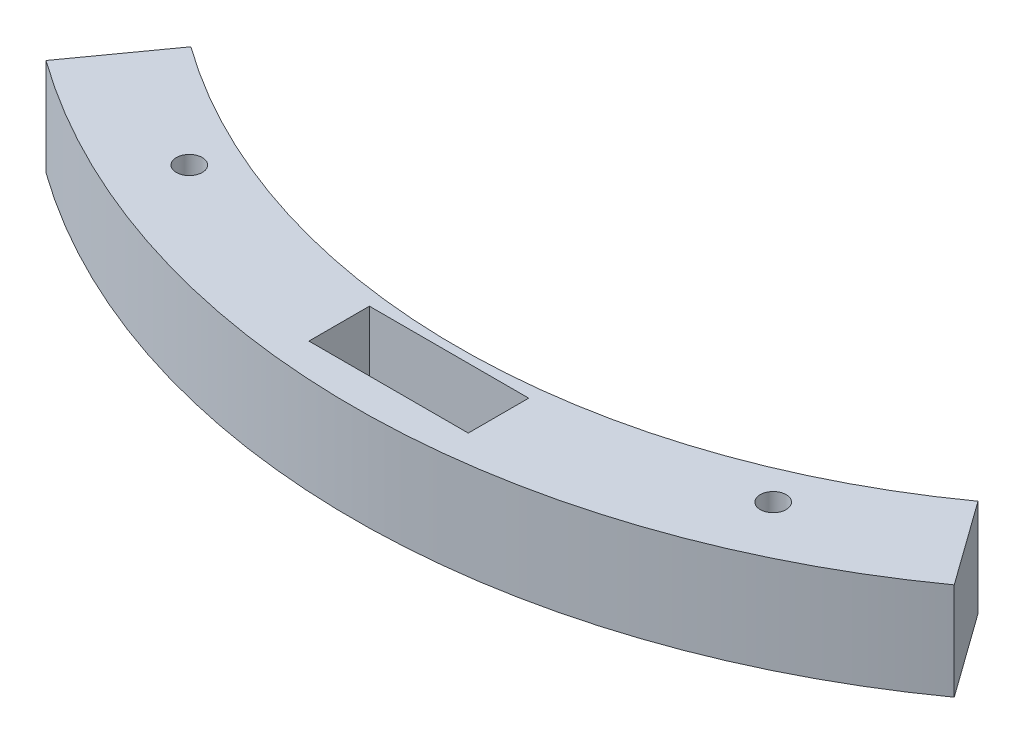
ISO-10303-21;
HEADER;
FILE_DESCRIPTION(('STEP AP214'),'2;1');
FILE_NAME('part.step','',(''),(''),'','','');
FILE_SCHEMA(('AUTOMOTIVE_DESIGN { 1 0 10303 214 1 1 1 1 }'));
ENDSEC;
DATA;
#1=APPLICATION_CONTEXT('core data for automotive mechanical design processes');
#2=APPLICATION_PROTOCOL_DEFINITION('international standard','automotive_design',2000,#1);
#3=PRODUCT_CONTEXT('',#1,'mechanical');
#4=PRODUCT('Part','Part','',(#3));
#5=PRODUCT_RELATED_PRODUCT_CATEGORY('part','',(#4));
#6=PRODUCT_DEFINITION_FORMATION('','',#4);
#7=PRODUCT_DEFINITION_CONTEXT('part definition',#1,'design');
#8=PRODUCT_DEFINITION('design','',#6,#7);
#9=PRODUCT_DEFINITION_SHAPE('','',#8);
#10=(LENGTH_UNIT() NAMED_UNIT(*) SI_UNIT(.MILLI.,.METRE.));
#11=(NAMED_UNIT(*) PLANE_ANGLE_UNIT() SI_UNIT($,.RADIAN.));
#12=(NAMED_UNIT(*) SI_UNIT($,.STERADIAN.) SOLID_ANGLE_UNIT());
#13=UNCERTAINTY_MEASURE_WITH_UNIT(LENGTH_MEASURE(1.E-05),#10,'distance_accuracy_value','');
#14=(GEOMETRIC_REPRESENTATION_CONTEXT(3) GLOBAL_UNCERTAINTY_ASSIGNED_CONTEXT((#13)) GLOBAL_UNIT_ASSIGNED_CONTEXT((#10,
#11,#12)) REPRESENTATION_CONTEXT('',''));
#15=CARTESIAN_POINT('',(0.,0.,0.));
#16=DIRECTION('',(0.,0.,1.));
#17=DIRECTION('',(1.,0.,0.));
#18=AXIS2_PLACEMENT_3D('',#15,#16,#17);
#19=CARTESIAN_POINT('',(-5.14,7.5,56.33));
#20=DIRECTION('',(0.,0.,-1.));
#21=DIRECTION('',(-1.,0.,0.));
#22=AXIS2_PLACEMENT_3D('',#19,#20,#21);
#23=PLANE('',#22);
#24=DIRECTION('',(0.,-1.,0.));
#25=VECTOR('',#24,1.);
#26=CARTESIAN_POINT('',(-5.14,7.5,56.33));
#27=LINE('',#26,#25);
#28=CARTESIAN_POINT('',(-5.14,2.,56.33));
#29=VERTEX_POINT('',#28);
#30=CARTESIAN_POINT('',(-5.14,0.,56.33));
#31=VERTEX_POINT('',#30);
#32=EDGE_CURVE('E189',#29,#31,#27,.T.);
#33=ORIENTED_EDGE('',*,*,#32,.F.);
#34=DIRECTION('',(1.,0.,0.));
#35=VECTOR('',#34,1.);
#36=CARTESIAN_POINT('',(-5.14,2.,56.33));
#37=LINE('',#36,#35);
#38=CARTESIAN_POINT('',(5.14000000000001,2.,56.33));
#39=VERTEX_POINT('',#38);
#40=EDGE_CURVE('E58',#29,#39,#37,.T.);
#41=ORIENTED_EDGE('',*,*,#40,.T.);
#42=DIRECTION('',(0.,-1.,0.));
#43=VECTOR('',#42,1.);
#44=CARTESIAN_POINT('',(5.14000000000001,7.5,56.33));
#45=LINE('',#44,#43);
#46=CARTESIAN_POINT('',(5.14000000000001,0.,56.33));
#47=VERTEX_POINT('',#46);
#48=EDGE_CURVE('E195',#39,#47,#45,.T.);
#49=ORIENTED_EDGE('',*,*,#48,.T.);
#50=DIRECTION('',(1.,0.,0.));
#51=VECTOR('',#50,1.);
#52=CARTESIAN_POINT('',(-5.14,0.,56.33));
#53=LINE('',#52,#51);
#54=EDGE_CURVE('E175',#31,#47,#53,.T.);
#55=ORIENTED_EDGE('',*,*,#54,.F.);
#56=EDGE_LOOP('',(#33,#41,#49,#55));
#57=FACE_BOUND('',#56,.T.);
#58=ADVANCED_FACE('F35',(#57),#23,.T.);
#59=CARTESIAN_POINT('',(5.14000000000001,7.5,56.33));
#60=DIRECTION('',(-1.,0.,0.));
#61=DIRECTION('',(0.,0.,1.));
#62=AXIS2_PLACEMENT_3D('',#59,#60,#61);
#63=PLANE('',#62);
#64=ORIENTED_EDGE('',*,*,#48,.F.);
#65=DIRECTION('',(0.,0.,-1.));
#66=VECTOR('',#65,1.);
#67=CARTESIAN_POINT('',(5.14000000000001,2.,56.33));
#68=LINE('',#67,#66);
#69=CARTESIAN_POINT('',(5.14000000000001,2.,53.67));
#70=VERTEX_POINT('',#69);
#71=EDGE_CURVE('E161',#39,#70,#68,.T.);
#72=ORIENTED_EDGE('',*,*,#71,.T.);
#73=DIRECTION('',(0.,-1.,0.));
#74=VECTOR('',#73,1.);
#75=CARTESIAN_POINT('',(5.14000000000001,7.5,53.67));
#76=LINE('',#75,#74);
#77=CARTESIAN_POINT('',(5.14000000000001,0.,53.67));
#78=VERTEX_POINT('',#77);
#79=EDGE_CURVE('E193',#70,#78,#76,.T.);
#80=ORIENTED_EDGE('',*,*,#79,.T.);
#81=DIRECTION('',(0.,0.,-1.));
#82=VECTOR('',#81,1.);
#83=CARTESIAN_POINT('',(5.14000000000001,0.,56.33));
#84=LINE('',#83,#82);
#85=EDGE_CURVE('E180',#47,#78,#84,.T.);
#86=ORIENTED_EDGE('',*,*,#85,.F.);
#87=EDGE_LOOP('',(#64,#72,#80,#86));
#88=FACE_BOUND('',#87,.T.);
#89=ADVANCED_FACE('F266',(#88),#63,.T.);
#90=CARTESIAN_POINT('',(-5.14,7.5,53.67));
#91=DIRECTION('',(0.,0.,1.));
#92=DIRECTION('',(1.,0.,0.));
#93=AXIS2_PLACEMENT_3D('',#90,#91,#92);
#94=PLANE('',#93);
#95=ORIENTED_EDGE('',*,*,#79,.F.);
#96=DIRECTION('',(-1.,0.,0.));
#97=VECTOR('',#96,1.);
#98=CARTESIAN_POINT('',(-5.14,2.,53.67));
#99=LINE('',#98,#97);
#100=CARTESIAN_POINT('',(-5.14,2.,53.67));
#101=VERTEX_POINT('',#100);
#102=EDGE_CURVE('E157',#70,#101,#99,.T.);
#103=ORIENTED_EDGE('',*,*,#102,.T.);
#104=DIRECTION('',(0.,-1.,0.));
#105=VECTOR('',#104,1.);
#106=CARTESIAN_POINT('',(-5.14,7.5,53.67));
#107=LINE('',#106,#105);
#108=CARTESIAN_POINT('',(-5.14,0.,53.67));
#109=VERTEX_POINT('',#108);
#110=EDGE_CURVE('E191',#101,#109,#107,.T.);
#111=ORIENTED_EDGE('',*,*,#110,.T.);
#112=DIRECTION('',(-1.,0.,0.));
#113=VECTOR('',#112,1.);
#114=CARTESIAN_POINT('',(-5.14,0.,53.67));
#115=LINE('',#114,#113);
#116=EDGE_CURVE('E183',#78,#109,#115,.T.);
#117=ORIENTED_EDGE('',*,*,#116,.F.);
#118=EDGE_LOOP('',(#95,#103,#111,#117));
#119=FACE_BOUND('',#118,.T.);
#120=ADVANCED_FACE('F272',(#119),#94,.T.);
#121=CARTESIAN_POINT('',(-5.14,7.5,56.33));
#122=DIRECTION('',(1.,0.,0.));
#123=DIRECTION('',(0.,0.,-1.));
#124=AXIS2_PLACEMENT_3D('',#121,#122,#123);
#125=PLANE('',#124);
#126=ORIENTED_EDGE('',*,*,#110,.F.);
#127=DIRECTION('',(0.,0.,1.));
#128=VECTOR('',#127,1.);
#129=CARTESIAN_POINT('',(-5.14,2.,56.33));
#130=LINE('',#129,#128);
#131=EDGE_CURVE('E12',#101,#29,#130,.T.);
#132=ORIENTED_EDGE('',*,*,#131,.T.);
#133=ORIENTED_EDGE('',*,*,#32,.T.);
#134=DIRECTION('',(0.,0.,1.));
#135=VECTOR('',#134,1.);
#136=CARTESIAN_POINT('',(-5.14,0.,56.33));
#137=LINE('',#136,#135);
#138=EDGE_CURVE('E186',#109,#31,#137,.T.);
#139=ORIENTED_EDGE('',*,*,#138,.F.);
#140=EDGE_LOOP('',(#126,#132,#133,#139));
#141=FACE_BOUND('',#140,.T.);
#142=ADVANCED_FACE('F247',(#141),#125,.T.);
#143=CARTESIAN_POINT('',(0.,7.5,0.));
#144=DIRECTION('',(0.,1.,0.));
#145=DIRECTION('',(0.,0.,1.));
#146=AXIS2_PLACEMENT_3D('',#143,#144,#145);
#147=PLANE('',#146);
#148=DIRECTION('',(0.,0.,-1.));
#149=VECTOR('',#148,1.);
#150=CARTESIAN_POINT('',(6.14000000000001,7.5,57.33));
#151=LINE('',#150,#149);
#152=CARTESIAN_POINT('',(6.14000000000001,7.5,57.33));
#153=VERTEX_POINT('',#152);
#154=CARTESIAN_POINT('',(6.14000000000001,7.5,52.67));
#155=VERTEX_POINT('',#154);
#156=EDGE_CURVE('E50',#153,#155,#151,.T.);
#157=ORIENTED_EDGE('',*,*,#156,.F.);
#158=DIRECTION('',(1.,0.,0.));
#159=VECTOR('',#158,1.);
#160=CARTESIAN_POINT('',(-6.14,7.5,57.33));
#161=LINE('',#160,#159);
#162=CARTESIAN_POINT('',(-6.14,7.5,57.33));
#163=VERTEX_POINT('',#162);
#164=EDGE_CURVE('E146',#163,#153,#161,.T.);
#165=ORIENTED_EDGE('',*,*,#164,.F.);
#166=DIRECTION('',(0.,0.,1.));
#167=VECTOR('',#166,1.);
#168=CARTESIAN_POINT('',(-6.14,7.5,52.67));
#169=LINE('',#168,#167);
#170=CARTESIAN_POINT('',(-6.14,7.5,52.67));
#171=VERTEX_POINT('',#170);
#172=EDGE_CURVE('E129',#171,#163,#169,.T.);
#173=ORIENTED_EDGE('',*,*,#172,.F.);
#174=DIRECTION('',(-1.,0.,0.));
#175=VECTOR('',#174,1.);
#176=CARTESIAN_POINT('',(6.14000000000001,7.5,52.67));
#177=LINE('',#176,#175);
#178=EDGE_CURVE('E139',#155,#171,#177,.T.);
#179=ORIENTED_EDGE('',*,*,#178,.F.);
#180=EDGE_LOOP('',(#157,#165,#173,#179));
#181=FACE_BOUND('',#180,.T.);
#182=CARTESIAN_POINT('',(-22.5,7.5,50.1871497497118));
#183=DIRECTION('',(0.,1.,0.));
#184=DIRECTION('',(0.,0.,1.));
#185=AXIS2_PLACEMENT_3D('',#182,#183,#184);
#186=CIRCLE('',#185,1.);
#187=CARTESIAN_POINT('',(-22.5,7.5,51.1871497497118));
#188=VERTEX_POINT('',#187);
#189=EDGE_CURVE('E172',#188,#188,#186,.T.);
#190=ORIENTED_EDGE('',*,*,#189,.F.);
#191=EDGE_LOOP('',(#190));
#192=FACE_BOUND('',#191,.T.);
#193=CARTESIAN_POINT('',(0.,7.5,0.));
#194=DIRECTION('',(0.,-1.,0.));
#195=DIRECTION('',(0.,0.,1.));
#196=AXIS2_PLACEMENT_3D('',#193,#194,#195);
#197=CIRCLE('',#196,52.);
#198=CARTESIAN_POINT('',(30.3333333333333,7.5,42.2361088275055));
#199=VERTEX_POINT('',#198);
#200=CARTESIAN_POINT('',(-30.3333333333333,7.5,42.2361088275055));
#201=VERTEX_POINT('',#200);
#202=EDGE_CURVE('E198',#199,#201,#197,.T.);
#203=ORIENTED_EDGE('',*,*,#202,.T.);
#204=DIRECTION('',(-0.583333333333332,0.,0.812232862067415));
#205=VECTOR('',#204,1.);
#206=CARTESIAN_POINT('',(-35.,7.5,48.7339717240448));
#207=LINE('',#206,#205);
#208=CARTESIAN_POINT('',(-35.,7.5,48.7339717240448));
#209=VERTEX_POINT('',#208);
#210=EDGE_CURVE('E201',#201,#209,#207,.T.);
#211=ORIENTED_EDGE('',*,*,#210,.T.);
#212=CARTESIAN_POINT('',(0.,7.5,0.));
#213=DIRECTION('',(0.,1.,0.));
#214=DIRECTION('',(0.,0.,1.));
#215=AXIS2_PLACEMENT_3D('',#212,#213,#214);
#216=CIRCLE('',#215,60.);
#217=CARTESIAN_POINT('',(35.,7.5,48.7339717240448));
#218=VERTEX_POINT('',#217);
#219=EDGE_CURVE('E204',#209,#218,#216,.T.);
#220=ORIENTED_EDGE('',*,*,#219,.T.);
#221=DIRECTION('',(-0.583333333333334,0.,-0.812232862067413));
#222=VECTOR('',#221,1.);
#223=CARTESIAN_POINT('',(35.,7.5,48.7339717240448));
#224=LINE('',#223,#222);
#225=EDGE_CURVE('E206',#218,#199,#224,.T.);
#226=ORIENTED_EDGE('',*,*,#225,.T.);
#227=EDGE_LOOP('',(#203,#211,#220,#226));
#228=FACE_BOUND('',#227,.T.);
#229=CARTESIAN_POINT('',(22.5,7.5,50.1871497497118));
#230=DIRECTION('',(0.,1.,0.));
#231=DIRECTION('',(0.,0.,1.));
#232=AXIS2_PLACEMENT_3D('',#229,#230,#231);
#233=CIRCLE('',#232,1.);
#234=CARTESIAN_POINT('',(22.5,7.5,51.1871497497118));
#235=VERTEX_POINT('',#234);
#236=EDGE_CURVE('E166',#235,#235,#233,.T.);
#237=ORIENTED_EDGE('',*,*,#236,.F.);
#238=EDGE_LOOP('',(#237));
#239=FACE_BOUND('',#238,.T.);
#240=ADVANCED_FACE('F143',(#181,#192,#228,#239),#147,.T.);
#241=CARTESIAN_POINT('',(0.,0.,0.));
#242=DIRECTION('',(0.,1.,0.));
#243=DIRECTION('',(0.,0.,1.));
#244=AXIS2_PLACEMENT_3D('',#241,#242,#243);
#245=PLANE('',#244);
#246=CARTESIAN_POINT('',(0.,0.,0.));
#247=DIRECTION('',(0.,-1.,0.));
#248=DIRECTION('',(0.,0.,1.));
#249=AXIS2_PLACEMENT_3D('',#246,#247,#248);
#250=CIRCLE('',#249,52.);
#251=CARTESIAN_POINT('',(30.3333333333333,0.,42.2361088275055));
#252=VERTEX_POINT('',#251);
#253=CARTESIAN_POINT('',(-30.3333333333333,0.,42.2361088275055));
#254=VERTEX_POINT('',#253);
#255=EDGE_CURVE('E197',#252,#254,#250,.T.);
#256=ORIENTED_EDGE('',*,*,#255,.F.);
#257=DIRECTION('',(-0.583333333333334,0.,-0.812232862067413));
#258=VECTOR('',#257,1.);
#259=CARTESIAN_POINT('',(35.,0.,48.7339717240448));
#260=LINE('',#259,#258);
#261=CARTESIAN_POINT('',(35.,0.,48.7339717240448));
#262=VERTEX_POINT('',#261);
#263=EDGE_CURVE('E202',#262,#252,#260,.T.);
#264=ORIENTED_EDGE('',*,*,#263,.F.);
#265=CARTESIAN_POINT('',(0.,0.,0.));
#266=DIRECTION('',(0.,1.,0.));
#267=DIRECTION('',(0.,0.,1.));
#268=AXIS2_PLACEMENT_3D('',#265,#266,#267);
#269=CIRCLE('',#268,60.);
#270=CARTESIAN_POINT('',(-35.,0.,48.7339717240448));
#271=VERTEX_POINT('',#270);
#272=EDGE_CURVE('E213',#271,#262,#269,.T.);
#273=ORIENTED_EDGE('',*,*,#272,.F.);
#274=DIRECTION('',(-0.583333333333332,0.,0.812232862067415));
#275=VECTOR('',#274,1.);
#276=CARTESIAN_POINT('',(-35.,0.,48.7339717240448));
#277=LINE('',#276,#275);
#278=EDGE_CURVE('E211',#254,#271,#277,.T.);
#279=ORIENTED_EDGE('',*,*,#278,.F.);
#280=EDGE_LOOP('',(#256,#264,#273,#279));
#281=FACE_BOUND('',#280,.T.);
#282=ORIENTED_EDGE('',*,*,#54,.T.);
#283=ORIENTED_EDGE('',*,*,#85,.T.);
#284=ORIENTED_EDGE('',*,*,#116,.T.);
#285=ORIENTED_EDGE('',*,*,#138,.T.);
#286=EDGE_LOOP('',(#282,#283,#284,#285));
#287=FACE_BOUND('',#286,.T.);
#288=CARTESIAN_POINT('',(-22.5,0.,50.1871497497118));
#289=DIRECTION('',(0.,1.,0.));
#290=DIRECTION('',(0.,0.,1.));
#291=AXIS2_PLACEMENT_3D('',#288,#289,#290);
#292=CIRCLE('',#291,1.);
#293=CARTESIAN_POINT('',(-22.5,0.,51.1871497497118));
#294=VERTEX_POINT('',#293);
#295=EDGE_CURVE('E169',#294,#294,#292,.T.);
#296=ORIENTED_EDGE('',*,*,#295,.T.);
#297=EDGE_LOOP('',(#296));
#298=FACE_BOUND('',#297,.T.);
#299=CARTESIAN_POINT('',(22.5,0.,50.1871497497118));
#300=DIRECTION('',(0.,1.,0.));
#301=DIRECTION('',(0.,0.,1.));
#302=AXIS2_PLACEMENT_3D('',#299,#300,#301);
#303=CIRCLE('',#302,1.);
#304=CARTESIAN_POINT('',(22.5,0.,51.1871497497118));
#305=VERTEX_POINT('',#304);
#306=EDGE_CURVE('E165',#305,#305,#303,.T.);
#307=ORIENTED_EDGE('',*,*,#306,.T.);
#308=EDGE_LOOP('',(#307));
#309=FACE_BOUND('',#308,.T.);
#310=ADVANCED_FACE('F234',(#281,#287,#298,#309),#245,.F.);
#311=CARTESIAN_POINT('',(0.,7.5,0.));
#312=DIRECTION('',(0.,-1.,0.));
#313=DIRECTION('',(0.,0.,-1.));
#314=AXIS2_PLACEMENT_3D('',#311,#312,#313);
#315=CYLINDRICAL_SURFACE('',#314,52.);
#316=ORIENTED_EDGE('',*,*,#255,.T.);
#317=DIRECTION('',(0.,-1.,0.));
#318=VECTOR('',#317,1.);
#319=CARTESIAN_POINT('',(-30.3333333333333,7.5,42.2361088275055));
#320=LINE('',#319,#318);
#321=EDGE_CURVE('E43',#201,#254,#320,.T.);
#322=ORIENTED_EDGE('',*,*,#321,.F.);
#323=ORIENTED_EDGE('',*,*,#202,.F.);
#324=DIRECTION('',(0.,-1.,0.));
#325=VECTOR('',#324,1.);
#326=CARTESIAN_POINT('',(30.3333333333333,7.5,42.2361088275055));
#327=LINE('',#326,#325);
#328=EDGE_CURVE('E208',#199,#252,#327,.T.);
#329=ORIENTED_EDGE('',*,*,#328,.T.);
#330=EDGE_LOOP('',(#316,#322,#323,#329));
#331=FACE_BOUND('',#330,.T.);
#332=ADVANCED_FACE('F37',(#331),#315,.F.);
#333=CARTESIAN_POINT('',(-35.,7.5,48.7339717240448));
#334=DIRECTION('',(0.812232862067415,0.,0.583333333333332));
#335=DIRECTION('',(0.583333333333332,0.,-0.812232862067415));
#336=AXIS2_PLACEMENT_3D('',#333,#334,#335);
#337=PLANE('',#336);
#338=ORIENTED_EDGE('',*,*,#278,.T.);
#339=DIRECTION('',(0.,-1.,0.));
#340=VECTOR('',#339,1.);
#341=CARTESIAN_POINT('',(-35.,7.5,48.7339717240448));
#342=LINE('',#341,#340);
#343=EDGE_CURVE('E221',#209,#271,#342,.T.);
#344=ORIENTED_EDGE('',*,*,#343,.F.);
#345=ORIENTED_EDGE('',*,*,#210,.F.);
#346=ORIENTED_EDGE('',*,*,#321,.T.);
#347=EDGE_LOOP('',(#338,#344,#345,#346));
#348=FACE_BOUND('',#347,.T.);
#349=ADVANCED_FACE('F226',(#348),#337,.F.);
#350=CARTESIAN_POINT('',(0.,7.5,0.));
#351=DIRECTION('',(0.,-1.,0.));
#352=DIRECTION('',(0.,0.,-1.));
#353=AXIS2_PLACEMENT_3D('',#350,#351,#352);
#354=CYLINDRICAL_SURFACE('',#353,60.);
#355=ORIENTED_EDGE('',*,*,#272,.T.);
#356=DIRECTION('',(0.,-1.,0.));
#357=VECTOR('',#356,1.);
#358=CARTESIAN_POINT('',(35.,7.5,48.7339717240448));
#359=LINE('',#358,#357);
#360=EDGE_CURVE('E218',#218,#262,#359,.T.);
#361=ORIENTED_EDGE('',*,*,#360,.F.);
#362=ORIENTED_EDGE('',*,*,#219,.F.);
#363=ORIENTED_EDGE('',*,*,#343,.T.);
#364=EDGE_LOOP('',(#355,#361,#362,#363));
#365=FACE_BOUND('',#364,.T.);
#366=ADVANCED_FACE('F239',(#365),#354,.T.);
#367=CARTESIAN_POINT('',(35.,7.5,48.7339717240448));
#368=DIRECTION('',(-0.812232862067413,0.,0.583333333333334));
#369=DIRECTION('',(0.583333333333334,0.,0.812232862067413));
#370=AXIS2_PLACEMENT_3D('',#367,#368,#369);
#371=PLANE('',#370);
#372=ORIENTED_EDGE('',*,*,#263,.T.);
#373=ORIENTED_EDGE('',*,*,#328,.F.);
#374=ORIENTED_EDGE('',*,*,#225,.F.);
#375=ORIENTED_EDGE('',*,*,#360,.T.);
#376=EDGE_LOOP('',(#372,#373,#374,#375));
#377=FACE_BOUND('',#376,.T.);
#378=ADVANCED_FACE('F243',(#377),#371,.F.);
#379=CARTESIAN_POINT('',(-22.5,7.5,50.1871497497118));
#380=DIRECTION('',(0.,-1.,0.));
#381=DIRECTION('',(0.,0.,-1.));
#382=AXIS2_PLACEMENT_3D('',#379,#380,#381);
#383=CYLINDRICAL_SURFACE('',#382,1.);
#384=ORIENTED_EDGE('',*,*,#189,.T.);
#385=EDGE_LOOP('',(#384));
#386=FACE_BOUND('',#385,.T.);
#387=ORIENTED_EDGE('',*,*,#295,.F.);
#388=EDGE_LOOP('',(#387));
#389=FACE_BOUND('',#388,.T.);
#390=ADVANCED_FACE('F255',(#386,#389),#383,.F.);
#391=CARTESIAN_POINT('',(22.5,7.5,50.1871497497118));
#392=DIRECTION('',(0.,-1.,0.));
#393=DIRECTION('',(0.,0.,-1.));
#394=AXIS2_PLACEMENT_3D('',#391,#392,#393);
#395=CYLINDRICAL_SURFACE('',#394,1.);
#396=ORIENTED_EDGE('',*,*,#236,.T.);
#397=EDGE_LOOP('',(#396));
#398=FACE_BOUND('',#397,.T.);
#399=ORIENTED_EDGE('',*,*,#306,.F.);
#400=EDGE_LOOP('',(#399));
#401=FACE_BOUND('',#400,.T.);
#402=ADVANCED_FACE('F251',(#398,#401),#395,.F.);
#403=CARTESIAN_POINT('',(6.14000000000001,-13.1344584966416,57.33));
#404=DIRECTION('',(1.,0.,0.));
#405=DIRECTION('',(0.,0.,-1.));
#406=AXIS2_PLACEMENT_3D('',#403,#404,#405);
#407=PLANE('',#406);
#408=DIRECTION('',(0.,0.,1.));
#409=VECTOR('',#408,1.);
#410=CARTESIAN_POINT('',(6.14000000000001,2.,57.33));
#411=LINE('',#410,#409);
#412=CARTESIAN_POINT('',(6.14000000000001,2.,52.67));
#413=VERTEX_POINT('',#412);
#414=CARTESIAN_POINT('',(6.14000000000001,2.,57.33));
#415=VERTEX_POINT('',#414);
#416=EDGE_CURVE('E158',#413,#415,#411,.T.);
#417=ORIENTED_EDGE('',*,*,#416,.T.);
#418=DIRECTION('',(0.,1.,0.));
#419=VECTOR('',#418,1.);
#420=CARTESIAN_POINT('',(6.14000000000001,-13.1344584966416,57.33));
#421=LINE('',#420,#419);
#422=EDGE_CURVE('E151',#415,#153,#421,.T.);
#423=ORIENTED_EDGE('',*,*,#422,.T.);
#424=ORIENTED_EDGE('',*,*,#156,.T.);
#425=DIRECTION('',(0.,1.,0.));
#426=VECTOR('',#425,1.);
#427=CARTESIAN_POINT('',(6.14000000000001,-13.1344584966416,52.67));
#428=LINE('',#427,#426);
#429=EDGE_CURVE('E136',#413,#155,#428,.T.);
#430=ORIENTED_EDGE('',*,*,#429,.F.);
#431=EDGE_LOOP('',(#417,#423,#424,#430));
#432=FACE_BOUND('',#431,.T.);
#433=ADVANCED_FACE('F254',(#432),#407,.F.);
#434=CARTESIAN_POINT('',(-6.14,-13.1344584966416,57.33));
#435=DIRECTION('',(0.,0.,1.));
#436=DIRECTION('',(1.,0.,0.));
#437=AXIS2_PLACEMENT_3D('',#434,#435,#436);
#438=PLANE('',#437);
#439=DIRECTION('',(-1.,0.,0.));
#440=VECTOR('',#439,1.);
#441=CARTESIAN_POINT('',(-6.14,2.,57.33));
#442=LINE('',#441,#440);
#443=CARTESIAN_POINT('',(-6.14,2.,57.33));
#444=VERTEX_POINT('',#443);
#445=EDGE_CURVE('E303',#415,#444,#442,.T.);
#446=ORIENTED_EDGE('',*,*,#445,.T.);
#447=DIRECTION('',(0.,1.,0.));
#448=VECTOR('',#447,1.);
#449=CARTESIAN_POINT('',(-6.14,-13.1344584966416,57.33));
#450=LINE('',#449,#448);
#451=EDGE_CURVE('E135',#444,#163,#450,.T.);
#452=ORIENTED_EDGE('',*,*,#451,.T.);
#453=ORIENTED_EDGE('',*,*,#164,.T.);
#454=ORIENTED_EDGE('',*,*,#422,.F.);
#455=EDGE_LOOP('',(#446,#452,#453,#454));
#456=FACE_BOUND('',#455,.T.);
#457=ADVANCED_FACE('F288',(#456),#438,.F.);
#458=CARTESIAN_POINT('',(-6.14,-13.1344584966416,52.67));
#459=DIRECTION('',(-1.,0.,0.));
#460=DIRECTION('',(0.,0.,1.));
#461=AXIS2_PLACEMENT_3D('',#458,#459,#460);
#462=PLANE('',#461);
#463=DIRECTION('',(0.,0.,-1.));
#464=VECTOR('',#463,1.);
#465=CARTESIAN_POINT('',(-6.14,2.,52.67));
#466=LINE('',#465,#464);
#467=CARTESIAN_POINT('',(-6.14,2.,52.67));
#468=VERTEX_POINT('',#467);
#469=EDGE_CURVE('E132',#444,#468,#466,.T.);
#470=ORIENTED_EDGE('',*,*,#469,.T.);
#471=DIRECTION('',(0.,1.,0.));
#472=VECTOR('',#471,1.);
#473=CARTESIAN_POINT('',(-6.14,-13.1344584966416,52.67));
#474=LINE('',#473,#472);
#475=EDGE_CURVE('E124',#468,#171,#474,.T.);
#476=ORIENTED_EDGE('',*,*,#475,.T.);
#477=ORIENTED_EDGE('',*,*,#172,.T.);
#478=ORIENTED_EDGE('',*,*,#451,.F.);
#479=EDGE_LOOP('',(#470,#476,#477,#478));
#480=FACE_BOUND('',#479,.T.);
#481=ADVANCED_FACE('F126',(#480),#462,.F.);
#482=CARTESIAN_POINT('',(6.14000000000001,-13.1344584966416,52.67));
#483=DIRECTION('',(0.,0.,-1.));
#484=DIRECTION('',(-1.,0.,0.));
#485=AXIS2_PLACEMENT_3D('',#482,#483,#484);
#486=PLANE('',#485);
#487=DIRECTION('',(1.,0.,0.));
#488=VECTOR('',#487,1.);
#489=CARTESIAN_POINT('',(6.14000000000001,2.,52.67));
#490=LINE('',#489,#488);
#491=EDGE_CURVE('E155',#468,#413,#490,.T.);
#492=ORIENTED_EDGE('',*,*,#491,.T.);
#493=ORIENTED_EDGE('',*,*,#429,.T.);
#494=ORIENTED_EDGE('',*,*,#178,.T.);
#495=ORIENTED_EDGE('',*,*,#475,.F.);
#496=EDGE_LOOP('',(#492,#493,#494,#495));
#497=FACE_BOUND('',#496,.T.);
#498=ADVANCED_FACE('F140',(#497),#486,.F.);
#499=CARTESIAN_POINT('',(0.,2.,0.));
#500=DIRECTION('',(0.,1.,0.));
#501=DIRECTION('',(0.,0.,1.));
#502=AXIS2_PLACEMENT_3D('',#499,#500,#501);
#503=PLANE('',#502);
#504=ORIENTED_EDGE('',*,*,#131,.F.);
#505=ORIENTED_EDGE('',*,*,#102,.F.);
#506=ORIENTED_EDGE('',*,*,#71,.F.);
#507=ORIENTED_EDGE('',*,*,#40,.F.);
#508=EDGE_LOOP('',(#504,#505,#506,#507));
#509=FACE_BOUND('',#508,.T.);
#510=ORIENTED_EDGE('',*,*,#416,.F.);
#511=ORIENTED_EDGE('',*,*,#491,.F.);
#512=ORIENTED_EDGE('',*,*,#469,.F.);
#513=ORIENTED_EDGE('',*,*,#445,.F.);
#514=EDGE_LOOP('',(#510,#511,#512,#513));
#515=FACE_BOUND('',#514,.T.);
#516=ADVANCED_FACE('F291',(#509,#515),#503,.T.);
#517=CLOSED_SHELL('',(#58,#89,#120,#142,#240,#310,#332,#349,#366,#378,#390,#402,#433,#457,#481,
#498,#516));
#518=MANIFOLD_SOLID_BREP('B2',#517);
#519=ADVANCED_BREP_SHAPE_REPRESENTATION('',(#18,#518),#14);
#520=SHAPE_DEFINITION_REPRESENTATION(#9,#519);
ENDSEC;
END-ISO-10303-21;
